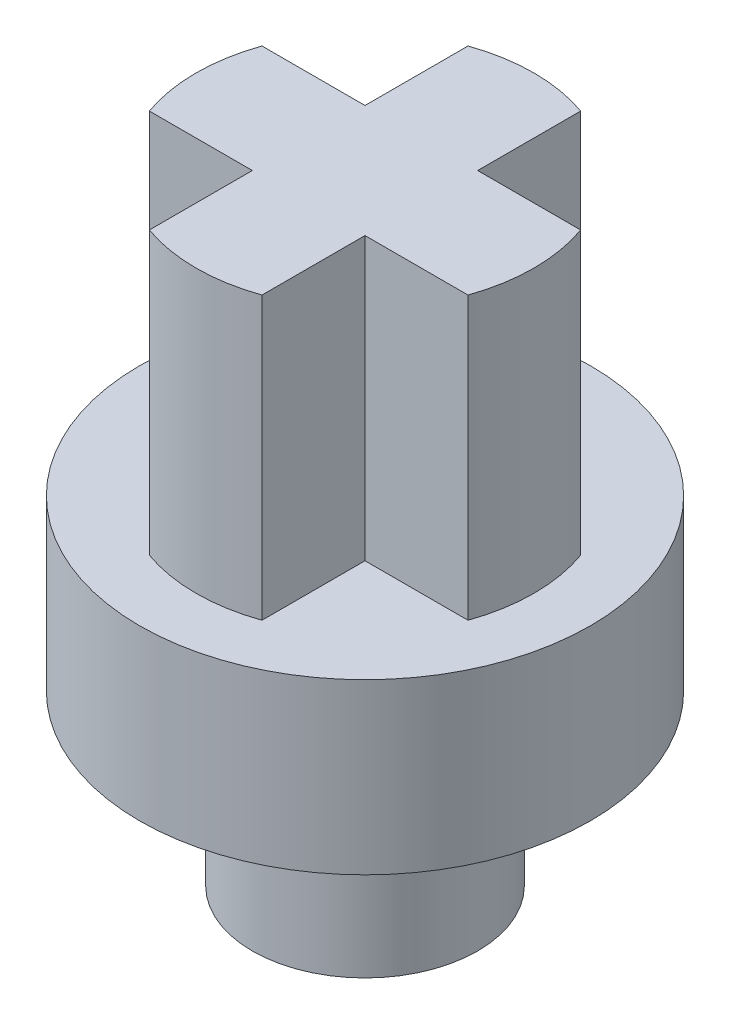
ISO-10303-21;
HEADER;
FILE_DESCRIPTION(('STEP AP214'),'2;1');
FILE_NAME('part.step','',(''),(''),'','','');
FILE_SCHEMA(('AUTOMOTIVE_DESIGN { 1 0 10303 214 1 1 1 1 }'));
ENDSEC;
DATA;
#1=APPLICATION_CONTEXT('core data for automotive mechanical design processes');
#2=APPLICATION_PROTOCOL_DEFINITION('international standard','automotive_design',2000,#1);
#3=PRODUCT_CONTEXT('',#1,'mechanical');
#4=PRODUCT('Part','Part','',(#3));
#5=PRODUCT_RELATED_PRODUCT_CATEGORY('part','',(#4));
#6=PRODUCT_DEFINITION_FORMATION('','',#4);
#7=PRODUCT_DEFINITION_CONTEXT('part definition',#1,'design');
#8=PRODUCT_DEFINITION('design','',#6,#7);
#9=PRODUCT_DEFINITION_SHAPE('','',#8);
#10=(LENGTH_UNIT() NAMED_UNIT(*) SI_UNIT(.MILLI.,.METRE.));
#11=(NAMED_UNIT(*) PLANE_ANGLE_UNIT() SI_UNIT($,.RADIAN.));
#12=(NAMED_UNIT(*) SI_UNIT($,.STERADIAN.) SOLID_ANGLE_UNIT());
#13=UNCERTAINTY_MEASURE_WITH_UNIT(LENGTH_MEASURE(1.E-05),#10,'distance_accuracy_value','');
#14=(GEOMETRIC_REPRESENTATION_CONTEXT(3) GLOBAL_UNCERTAINTY_ASSIGNED_CONTEXT((#13)) GLOBAL_UNIT_ASSIGNED_CONTEXT((#10,
#11,#12)) REPRESENTATION_CONTEXT('',''));
#15=CARTESIAN_POINT('',(0.,0.,0.));
#16=DIRECTION('',(0.,0.,1.));
#17=DIRECTION('',(1.,0.,0.));
#18=AXIS2_PLACEMENT_3D('',#15,#16,#17);
#19=CARTESIAN_POINT('',(-2.,-3.,0.));
#20=DIRECTION('',(0.,-1.,0.));
#21=DIRECTION('',(1.,0.,0.));
#22=AXIS2_PLACEMENT_3D('',#19,#20,#21);
#23=PLANE('',#22);
#24=CARTESIAN_POINT('',(0.,-3.,0.));
#25=DIRECTION('',(0.,1.,0.));
#26=DIRECTION('',(-1.,0.,0.));
#27=AXIS2_PLACEMENT_3D('',#24,#25,#26);
#28=CIRCLE('',#27,2.);
#29=CARTESIAN_POINT('',(-2.,-3.,0.));
#30=VERTEX_POINT('',#29);
#31=EDGE_CURVE('E123',#30,#30,#28,.T.);
#32=ORIENTED_EDGE('',*,*,#31,.F.);
#33=EDGE_LOOP('',(#32));
#34=FACE_BOUND('',#33,.T.);
#35=ADVANCED_FACE('F17',(#34),#23,.T.);
#36=CARTESIAN_POINT('',(0.,5.5,0.));
#37=DIRECTION('',(0.,1.,0.));
#38=DIRECTION('',(-1.,0.,0.));
#39=AXIS2_PLACEMENT_3D('',#36,#37,#38);
#40=CYLINDRICAL_SURFACE('',#39,3.);
#41=DIRECTION('',(0.,1.,0.));
#42=VECTOR('',#41,1.);
#43=CARTESIAN_POINT('',(-2.82842712474619,8.,0.999999999999999));
#44=LINE('',#43,#42);
#45=CARTESIAN_POINT('',(-2.82842712474619,3.,1.));
#46=VERTEX_POINT('',#45);
#47=CARTESIAN_POINT('',(-2.82842712474619,8.,0.999999999999999));
#48=VERTEX_POINT('',#47);
#49=EDGE_CURVE('E142',#46,#48,#44,.T.);
#50=ORIENTED_EDGE('',*,*,#49,.T.);
#51=CARTESIAN_POINT('',(0.,8.,0.));
#52=DIRECTION('',(0.,1.,0.));
#53=DIRECTION('',(-1.,0.,0.));
#54=AXIS2_PLACEMENT_3D('',#51,#52,#53);
#55=CIRCLE('',#54,3.);
#56=CARTESIAN_POINT('',(-2.82842712474619,8.,-1.));
#57=VERTEX_POINT('',#56);
#58=EDGE_CURVE('E115',#57,#48,#55,.T.);
#59=ORIENTED_EDGE('',*,*,#58,.F.);
#60=DIRECTION('',(0.,1.,0.));
#61=VECTOR('',#60,1.);
#62=CARTESIAN_POINT('',(-2.82842712474619,8.,-1.));
#63=LINE('',#62,#61);
#64=CARTESIAN_POINT('',(-2.82842712474619,3.,-1.));
#65=VERTEX_POINT('',#64);
#66=EDGE_CURVE('E117',#57,#65,#63,.F.);
#67=ORIENTED_EDGE('',*,*,#66,.T.);
#68=CARTESIAN_POINT('',(0.,3.,0.));
#69=DIRECTION('',(0.,1.,0.));
#70=DIRECTION('',(-1.,0.,0.));
#71=AXIS2_PLACEMENT_3D('',#68,#69,#70);
#72=CIRCLE('',#71,3.);
#73=EDGE_CURVE('E20',#65,#46,#72,.T.);
#74=ORIENTED_EDGE('',*,*,#73,.T.);
#75=EDGE_LOOP('',(#50,#59,#67,#74));
#76=FACE_BOUND('',#75,.T.);
#77=ADVANCED_FACE('F118',(#76),#40,.T.);
#78=CARTESIAN_POINT('',(0.,8.,0.));
#79=DIRECTION('',(0.,1.,0.));
#80=DIRECTION('',(-1.,0.,0.));
#81=AXIS2_PLACEMENT_3D('',#78,#79,#80);
#82=PLANE('',#81);
#83=DIRECTION('',(1.,0.,0.));
#84=VECTOR('',#83,1.);
#85=CARTESIAN_POINT('',(6.72560461051799,8.,-1.));
#86=LINE('',#85,#84);
#87=CARTESIAN_POINT('',(2.82842712474619,8.,-1.));
#88=VERTEX_POINT('',#87);
#89=CARTESIAN_POINT('',(0.999999999999997,8.,-1.));
#90=VERTEX_POINT('',#89);
#91=EDGE_CURVE('E168',#88,#90,#86,.F.);
#92=ORIENTED_EDGE('',*,*,#91,.T.);
#93=DIRECTION('',(0.,0.,1.));
#94=VECTOR('',#93,1.);
#95=CARTESIAN_POINT('',(0.999999999999997,8.,-1.));
#96=LINE('',#95,#94);
#97=CARTESIAN_POINT('',(0.999999999999996,8.,-2.82842712474619));
#98=VERTEX_POINT('',#97);
#99=EDGE_CURVE('E173',#90,#98,#96,.F.);
#100=ORIENTED_EDGE('',*,*,#99,.T.);
#101=CARTESIAN_POINT('',(0.,8.,0.));
#102=DIRECTION('',(0.,1.,0.));
#103=DIRECTION('',(-1.,0.,0.));
#104=AXIS2_PLACEMENT_3D('',#101,#102,#103);
#105=CIRCLE('',#104,3.);
#106=CARTESIAN_POINT('',(-0.999999999999999,8.,-2.82842712474619));
#107=VERTEX_POINT('',#106);
#108=EDGE_CURVE('E174',#107,#98,#105,.F.);
#109=ORIENTED_EDGE('',*,*,#108,.F.);
#110=DIRECTION('',(0.,0.,1.));
#111=VECTOR('',#110,1.);
#112=CARTESIAN_POINT('',(-1.,8.,-6.72560461051799));
#113=LINE('',#112,#111);
#114=CARTESIAN_POINT('',(-1.,8.,-1.));
#115=VERTEX_POINT('',#114);
#116=EDGE_CURVE('E179',#107,#115,#113,.T.);
#117=ORIENTED_EDGE('',*,*,#116,.T.);
#118=DIRECTION('',(1.,0.,0.));
#119=VECTOR('',#118,1.);
#120=CARTESIAN_POINT('',(-1.,8.,-1.));
#121=LINE('',#120,#119);
#122=EDGE_CURVE('E122',#115,#57,#121,.F.);
#123=ORIENTED_EDGE('',*,*,#122,.T.);
#124=ORIENTED_EDGE('',*,*,#58,.T.);
#125=DIRECTION('',(-1.,0.,0.));
#126=VECTOR('',#125,1.);
#127=CARTESIAN_POINT('',(-6.72560461051799,8.,1.));
#128=LINE('',#127,#126);
#129=CARTESIAN_POINT('',(-1.,8.,0.999999999999999));
#130=VERTEX_POINT('',#129);
#131=EDGE_CURVE('E103',#48,#130,#128,.F.);
#132=ORIENTED_EDGE('',*,*,#131,.T.);
#133=DIRECTION('',(0.,0.,-1.));
#134=VECTOR('',#133,1.);
#135=CARTESIAN_POINT('',(-1.,8.,1.));
#136=LINE('',#135,#134);
#137=CARTESIAN_POINT('',(-0.999999999999999,8.,2.82842712474619));
#138=VERTEX_POINT('',#137);
#139=EDGE_CURVE('E144',#130,#138,#136,.F.);
#140=ORIENTED_EDGE('',*,*,#139,.T.);
#141=CARTESIAN_POINT('',(0.,8.,0.));
#142=DIRECTION('',(0.,1.,0.));
#143=DIRECTION('',(-1.,0.,0.));
#144=AXIS2_PLACEMENT_3D('',#141,#142,#143);
#145=CIRCLE('',#144,3.);
#146=CARTESIAN_POINT('',(0.999999999999998,8.,2.82842712474619));
#147=VERTEX_POINT('',#146);
#148=EDGE_CURVE('E150',#147,#138,#145,.F.);
#149=ORIENTED_EDGE('',*,*,#148,.F.);
#150=DIRECTION('',(0.,0.,1.));
#151=VECTOR('',#150,1.);
#152=CARTESIAN_POINT('',(0.999999999999998,8.,6.72560461051799));
#153=LINE('',#152,#151);
#154=CARTESIAN_POINT('',(0.999999999999997,8.,1.));
#155=VERTEX_POINT('',#154);
#156=EDGE_CURVE('E156',#147,#155,#153,.F.);
#157=ORIENTED_EDGE('',*,*,#156,.T.);
#158=DIRECTION('',(-1.,0.,0.));
#159=VECTOR('',#158,1.);
#160=CARTESIAN_POINT('',(0.999999999999998,8.,1.));
#161=LINE('',#160,#159);
#162=CARTESIAN_POINT('',(2.82842712474619,8.,0.999999999999999));
#163=VERTEX_POINT('',#162);
#164=EDGE_CURVE('E161',#155,#163,#161,.F.);
#165=ORIENTED_EDGE('',*,*,#164,.T.);
#166=CARTESIAN_POINT('',(0.,8.,0.));
#167=DIRECTION('',(0.,1.,0.));
#168=DIRECTION('',(-1.,0.,0.));
#169=AXIS2_PLACEMENT_3D('',#166,#167,#168);
#170=CIRCLE('',#169,3.);
#171=EDGE_CURVE('E162',#88,#163,#170,.F.);
#172=ORIENTED_EDGE('',*,*,#171,.F.);
#173=EDGE_LOOP('',(#92,#100,#109,#117,#123,#124,#132,#140,#149,#157,#165,#172));
#174=FACE_BOUND('',#173,.T.);
#175=ADVANCED_FACE('F227',(#174),#82,.T.);
#176=CARTESIAN_POINT('',(0.,-1.5,0.));
#177=DIRECTION('',(0.,1.,0.));
#178=DIRECTION('',(-1.,0.,0.));
#179=AXIS2_PLACEMENT_3D('',#176,#177,#178);
#180=CYLINDRICAL_SURFACE('',#179,2.);
#181=ORIENTED_EDGE('',*,*,#31,.T.);
#182=EDGE_LOOP('',(#181));
#183=FACE_BOUND('',#182,.T.);
#184=CARTESIAN_POINT('',(0.,0.,0.));
#185=DIRECTION('',(0.,1.,0.));
#186=DIRECTION('',(-1.,0.,0.));
#187=AXIS2_PLACEMENT_3D('',#184,#185,#186);
#188=CIRCLE('',#187,2.);
#189=CARTESIAN_POINT('',(-2.,0.,0.));
#190=VERTEX_POINT('',#189);
#191=EDGE_CURVE('E130',#190,#190,#188,.T.);
#192=ORIENTED_EDGE('',*,*,#191,.F.);
#193=EDGE_LOOP('',(#192));
#194=FACE_BOUND('',#193,.T.);
#195=ADVANCED_FACE('F297',(#183,#194),#180,.T.);
#196=CARTESIAN_POINT('',(-1.,8.,-1.));
#197=DIRECTION('',(0.,0.,1.));
#198=DIRECTION('',(1.,0.,0.));
#199=AXIS2_PLACEMENT_3D('',#196,#197,#198);
#200=PLANE('',#199);
#201=DIRECTION('',(0.,1.,0.));
#202=VECTOR('',#201,1.);
#203=CARTESIAN_POINT('',(-1.,8.,-1.));
#204=LINE('',#203,#202);
#205=CARTESIAN_POINT('',(-0.999999999999999,3.,-0.999999999999999));
#206=VERTEX_POINT('',#205);
#207=EDGE_CURVE('E127',#115,#206,#204,.F.);
#208=ORIENTED_EDGE('',*,*,#207,.T.);
#209=DIRECTION('',(-1.,0.,0.));
#210=VECTOR('',#209,1.);
#211=CARTESIAN_POINT('',(0.,3.,-0.999999999999999));
#212=LINE('',#211,#210);
#213=EDGE_CURVE('E111',#65,#206,#212,.F.);
#214=ORIENTED_EDGE('',*,*,#213,.F.);
#215=ORIENTED_EDGE('',*,*,#66,.F.);
#216=ORIENTED_EDGE('',*,*,#122,.F.);
#217=EDGE_LOOP('',(#208,#214,#215,#216));
#218=FACE_BOUND('',#217,.T.);
#219=ADVANCED_FACE('F125',(#218),#200,.F.);
#220=CARTESIAN_POINT('',(-1.,8.,-6.72560461051799));
#221=DIRECTION('',(1.,0.,0.));
#222=DIRECTION('',(0.,1.,0.));
#223=AXIS2_PLACEMENT_3D('',#220,#221,#222);
#224=PLANE('',#223);
#225=ORIENTED_EDGE('',*,*,#207,.F.);
#226=ORIENTED_EDGE('',*,*,#116,.F.);
#227=DIRECTION('',(0.,1.,0.));
#228=VECTOR('',#227,1.);
#229=CARTESIAN_POINT('',(-0.999999999999998,5.5,-2.82842712474619));
#230=LINE('',#229,#228);
#231=CARTESIAN_POINT('',(-0.999999999999999,3.,-2.82842712474619));
#232=VERTEX_POINT('',#231);
#233=EDGE_CURVE('E175',#232,#107,#230,.T.);
#234=ORIENTED_EDGE('',*,*,#233,.F.);
#235=DIRECTION('',(0.,0.,1.));
#236=VECTOR('',#235,1.);
#237=CARTESIAN_POINT('',(-1.,3.,0.));
#238=LINE('',#237,#236);
#239=EDGE_CURVE('E129',#206,#232,#238,.F.);
#240=ORIENTED_EDGE('',*,*,#239,.F.);
#241=EDGE_LOOP('',(#225,#226,#234,#240));
#242=FACE_BOUND('',#241,.T.);
#243=ADVANCED_FACE('F270',(#242),#224,.F.);
#244=CARTESIAN_POINT('',(0.,5.5,0.));
#245=DIRECTION('',(0.,1.,0.));
#246=DIRECTION('',(-1.,0.,0.));
#247=AXIS2_PLACEMENT_3D('',#244,#245,#246);
#248=CYLINDRICAL_SURFACE('',#247,3.);
#249=ORIENTED_EDGE('',*,*,#233,.T.);
#250=ORIENTED_EDGE('',*,*,#108,.T.);
#251=DIRECTION('',(0.,1.,0.));
#252=VECTOR('',#251,1.);
#253=CARTESIAN_POINT('',(0.999999999999996,8.,-2.82842712474619));
#254=LINE('',#253,#252);
#255=CARTESIAN_POINT('',(0.999999999999998,3.,-2.82842712474619));
#256=VERTEX_POINT('',#255);
#257=EDGE_CURVE('E171',#98,#256,#254,.F.);
#258=ORIENTED_EDGE('',*,*,#257,.T.);
#259=CARTESIAN_POINT('',(0.,3.,0.));
#260=DIRECTION('',(0.,1.,0.));
#261=DIRECTION('',(-1.,0.,0.));
#262=AXIS2_PLACEMENT_3D('',#259,#260,#261);
#263=CIRCLE('',#262,3.);
#264=EDGE_CURVE('E132',#232,#256,#263,.F.);
#265=ORIENTED_EDGE('',*,*,#264,.F.);
#266=EDGE_LOOP('',(#249,#250,#258,#265));
#267=FACE_BOUND('',#266,.T.);
#268=ADVANCED_FACE('F268',(#267),#248,.T.);
#269=CARTESIAN_POINT('',(0.999999999999997,8.,-1.));
#270=DIRECTION('',(-1.,0.,0.));
#271=DIRECTION('',(0.,0.,1.));
#272=AXIS2_PLACEMENT_3D('',#269,#270,#271);
#273=PLANE('',#272);
#274=DIRECTION('',(0.,1.,0.));
#275=VECTOR('',#274,1.);
#276=CARTESIAN_POINT('',(0.999999999999997,8.,-1.));
#277=LINE('',#276,#275);
#278=CARTESIAN_POINT('',(0.999999999999998,3.,-1.));
#279=VERTEX_POINT('',#278);
#280=EDGE_CURVE('E166',#90,#279,#277,.F.);
#281=ORIENTED_EDGE('',*,*,#280,.T.);
#282=DIRECTION('',(0.,0.,1.));
#283=VECTOR('',#282,1.);
#284=CARTESIAN_POINT('',(0.999999999999998,3.,0.));
#285=LINE('',#284,#283);
#286=EDGE_CURVE('E221',#256,#279,#285,.T.);
#287=ORIENTED_EDGE('',*,*,#286,.F.);
#288=ORIENTED_EDGE('',*,*,#257,.F.);
#289=ORIENTED_EDGE('',*,*,#99,.F.);
#290=EDGE_LOOP('',(#281,#287,#288,#289));
#291=FACE_BOUND('',#290,.T.);
#292=ADVANCED_FACE('F263',(#291),#273,.F.);
#293=CARTESIAN_POINT('',(6.72560461051799,8.,-1.));
#294=DIRECTION('',(0.,0.,1.));
#295=DIRECTION('',(1.,0.,0.));
#296=AXIS2_PLACEMENT_3D('',#293,#294,#295);
#297=PLANE('',#296);
#298=ORIENTED_EDGE('',*,*,#280,.F.);
#299=ORIENTED_EDGE('',*,*,#91,.F.);
#300=DIRECTION('',(0.,1.,0.));
#301=VECTOR('',#300,1.);
#302=CARTESIAN_POINT('',(2.82842712474619,5.5,-0.999999999999999));
#303=LINE('',#302,#301);
#304=CARTESIAN_POINT('',(2.82842712474619,3.,-1.));
#305=VERTEX_POINT('',#304);
#306=EDGE_CURVE('E163',#305,#88,#303,.T.);
#307=ORIENTED_EDGE('',*,*,#306,.F.);
#308=DIRECTION('',(-1.,0.,0.));
#309=VECTOR('',#308,1.);
#310=CARTESIAN_POINT('',(0.,3.,-1.));
#311=LINE('',#310,#309);
#312=EDGE_CURVE('E219',#279,#305,#311,.F.);
#313=ORIENTED_EDGE('',*,*,#312,.F.);
#314=EDGE_LOOP('',(#298,#299,#307,#313));
#315=FACE_BOUND('',#314,.T.);
#316=ADVANCED_FACE('F259',(#315),#297,.F.);
#317=CARTESIAN_POINT('',(0.,5.5,0.));
#318=DIRECTION('',(0.,1.,0.));
#319=DIRECTION('',(-1.,0.,0.));
#320=AXIS2_PLACEMENT_3D('',#317,#318,#319);
#321=CYLINDRICAL_SURFACE('',#320,3.);
#322=ORIENTED_EDGE('',*,*,#306,.T.);
#323=ORIENTED_EDGE('',*,*,#171,.T.);
#324=DIRECTION('',(0.,1.,0.));
#325=VECTOR('',#324,1.);
#326=CARTESIAN_POINT('',(2.82842712474619,8.,0.999999999999999));
#327=LINE('',#326,#325);
#328=CARTESIAN_POINT('',(2.82842712474619,3.,0.999999999999999));
#329=VERTEX_POINT('',#328);
#330=EDGE_CURVE('E159',#163,#329,#327,.F.);
#331=ORIENTED_EDGE('',*,*,#330,.T.);
#332=CARTESIAN_POINT('',(0.,3.,0.));
#333=DIRECTION('',(0.,1.,0.));
#334=DIRECTION('',(-1.,0.,0.));
#335=AXIS2_PLACEMENT_3D('',#332,#333,#334);
#336=CIRCLE('',#335,3.);
#337=EDGE_CURVE('E215',#305,#329,#336,.F.);
#338=ORIENTED_EDGE('',*,*,#337,.F.);
#339=EDGE_LOOP('',(#322,#323,#331,#338));
#340=FACE_BOUND('',#339,.T.);
#341=ADVANCED_FACE('F254',(#340),#321,.T.);
#342=CARTESIAN_POINT('',(0.999999999999998,8.,1.));
#343=DIRECTION('',(0.,0.,-1.));
#344=DIRECTION('',(-1.,0.,0.));
#345=AXIS2_PLACEMENT_3D('',#342,#343,#344);
#346=PLANE('',#345);
#347=DIRECTION('',(0.,-1.,0.));
#348=VECTOR('',#347,1.);
#349=CARTESIAN_POINT('',(0.999999999999997,8.,1.));
#350=LINE('',#349,#348);
#351=CARTESIAN_POINT('',(0.999999999999999,3.,0.999999999999999));
#352=VERTEX_POINT('',#351);
#353=EDGE_CURVE('E154',#155,#352,#350,.T.);
#354=ORIENTED_EDGE('',*,*,#353,.T.);
#355=DIRECTION('',(-1.,0.,0.));
#356=VECTOR('',#355,1.);
#357=CARTESIAN_POINT('',(0.,3.,0.999999999999999));
#358=LINE('',#357,#356);
#359=EDGE_CURVE('E218',#329,#352,#358,.T.);
#360=ORIENTED_EDGE('',*,*,#359,.F.);
#361=ORIENTED_EDGE('',*,*,#330,.F.);
#362=ORIENTED_EDGE('',*,*,#164,.F.);
#363=EDGE_LOOP('',(#354,#360,#361,#362));
#364=FACE_BOUND('',#363,.T.);
#365=ADVANCED_FACE('F248',(#364),#346,.F.);
#366=CARTESIAN_POINT('',(0.999999999999998,8.,6.72560461051799));
#367=DIRECTION('',(-1.,0.,0.));
#368=DIRECTION('',(0.,-1.,0.));
#369=AXIS2_PLACEMENT_3D('',#366,#367,#368);
#370=PLANE('',#369);
#371=ORIENTED_EDGE('',*,*,#353,.F.);
#372=ORIENTED_EDGE('',*,*,#156,.F.);
#373=DIRECTION('',(0.,1.,0.));
#374=VECTOR('',#373,1.);
#375=CARTESIAN_POINT('',(0.999999999999999,5.5,2.82842712474619));
#376=LINE('',#375,#374);
#377=CARTESIAN_POINT('',(0.999999999999999,3.,2.82842712474619));
#378=VERTEX_POINT('',#377);
#379=EDGE_CURVE('E151',#378,#147,#376,.T.);
#380=ORIENTED_EDGE('',*,*,#379,.F.);
#381=DIRECTION('',(0.,0.,1.));
#382=VECTOR('',#381,1.);
#383=CARTESIAN_POINT('',(0.999999999999999,3.,0.));
#384=LINE('',#383,#382);
#385=EDGE_CURVE('E214',#352,#378,#384,.T.);
#386=ORIENTED_EDGE('',*,*,#385,.F.);
#387=EDGE_LOOP('',(#371,#372,#380,#386));
#388=FACE_BOUND('',#387,.T.);
#389=ADVANCED_FACE('F244',(#388),#370,.F.);
#390=CARTESIAN_POINT('',(0.,5.5,0.));
#391=DIRECTION('',(0.,1.,0.));
#392=DIRECTION('',(-1.,0.,0.));
#393=AXIS2_PLACEMENT_3D('',#390,#391,#392);
#394=CYLINDRICAL_SURFACE('',#393,3.);
#395=ORIENTED_EDGE('',*,*,#379,.T.);
#396=ORIENTED_EDGE('',*,*,#148,.T.);
#397=DIRECTION('',(0.,1.,0.));
#398=VECTOR('',#397,1.);
#399=CARTESIAN_POINT('',(-0.999999999999999,8.,2.82842712474619));
#400=LINE('',#399,#398);
#401=CARTESIAN_POINT('',(-0.999999999999998,3.,2.82842712474619));
#402=VERTEX_POINT('',#401);
#403=EDGE_CURVE('E148',#138,#402,#400,.F.);
#404=ORIENTED_EDGE('',*,*,#403,.T.);
#405=CARTESIAN_POINT('',(0.,3.,0.));
#406=DIRECTION('',(0.,1.,0.));
#407=DIRECTION('',(-1.,0.,0.));
#408=AXIS2_PLACEMENT_3D('',#405,#406,#407);
#409=CIRCLE('',#408,3.);
#410=EDGE_CURVE('E210',#378,#402,#409,.F.);
#411=ORIENTED_EDGE('',*,*,#410,.F.);
#412=EDGE_LOOP('',(#395,#396,#404,#411));
#413=FACE_BOUND('',#412,.T.);
#414=ADVANCED_FACE('F239',(#413),#394,.T.);
#415=CARTESIAN_POINT('',(-1.,8.,1.));
#416=DIRECTION('',(1.,0.,0.));
#417=DIRECTION('',(0.,0.,-1.));
#418=AXIS2_PLACEMENT_3D('',#415,#416,#417);
#419=PLANE('',#418);
#420=DIRECTION('',(0.,1.,0.));
#421=VECTOR('',#420,1.);
#422=CARTESIAN_POINT('',(-1.,8.,0.999999999999999));
#423=LINE('',#422,#421);
#424=CARTESIAN_POINT('',(-0.999999999999999,3.,0.999999999999999));
#425=VERTEX_POINT('',#424);
#426=EDGE_CURVE('E135',#130,#425,#423,.F.);
#427=ORIENTED_EDGE('',*,*,#426,.T.);
#428=DIRECTION('',(0.,0.,1.));
#429=VECTOR('',#428,1.);
#430=CARTESIAN_POINT('',(-0.999999999999998,3.,0.));
#431=LINE('',#430,#429);
#432=EDGE_CURVE('E213',#402,#425,#431,.F.);
#433=ORIENTED_EDGE('',*,*,#432,.F.);
#434=ORIENTED_EDGE('',*,*,#403,.F.);
#435=ORIENTED_EDGE('',*,*,#139,.F.);
#436=EDGE_LOOP('',(#427,#433,#434,#435));
#437=FACE_BOUND('',#436,.T.);
#438=ADVANCED_FACE('F233',(#437),#419,.F.);
#439=CARTESIAN_POINT('',(-6.72560461051799,8.,1.));
#440=DIRECTION('',(0.,0.,-1.));
#441=DIRECTION('',(-1.,0.,0.));
#442=AXIS2_PLACEMENT_3D('',#439,#440,#441);
#443=PLANE('',#442);
#444=ORIENTED_EDGE('',*,*,#426,.F.);
#445=ORIENTED_EDGE('',*,*,#131,.F.);
#446=ORIENTED_EDGE('',*,*,#49,.F.);
#447=DIRECTION('',(-1.,0.,0.));
#448=VECTOR('',#447,1.);
#449=CARTESIAN_POINT('',(0.,3.,1.));
#450=LINE('',#449,#448);
#451=EDGE_CURVE('E114',#425,#46,#450,.T.);
#452=ORIENTED_EDGE('',*,*,#451,.F.);
#453=EDGE_LOOP('',(#444,#445,#446,#452));
#454=FACE_BOUND('',#453,.T.);
#455=ADVANCED_FACE('F230',(#454),#443,.F.);
#456=CARTESIAN_POINT('',(-4.,0.,0.));
#457=DIRECTION('',(0.,-1.,0.));
#458=DIRECTION('',(1.,0.,0.));
#459=AXIS2_PLACEMENT_3D('',#456,#457,#458);
#460=PLANE('',#459);
#461=CARTESIAN_POINT('',(0.,0.,0.));
#462=DIRECTION('',(0.,1.,0.));
#463=DIRECTION('',(-1.,0.,0.));
#464=AXIS2_PLACEMENT_3D('',#461,#462,#463);
#465=CIRCLE('',#464,4.);
#466=CARTESIAN_POINT('',(-4.,0.,0.));
#467=VERTEX_POINT('',#466);
#468=EDGE_CURVE('E26',#467,#467,#465,.T.);
#469=ORIENTED_EDGE('',*,*,#468,.F.);
#470=EDGE_LOOP('',(#469));
#471=FACE_BOUND('',#470,.T.);
#472=ORIENTED_EDGE('',*,*,#191,.T.);
#473=EDGE_LOOP('',(#472));
#474=FACE_BOUND('',#473,.T.);
#475=ADVANCED_FACE('F306',(#471,#474),#460,.T.);
#476=CARTESIAN_POINT('',(0.,3.,0.));
#477=DIRECTION('',(0.,1.,0.));
#478=DIRECTION('',(-1.,0.,0.));
#479=AXIS2_PLACEMENT_3D('',#476,#477,#478);
#480=PLANE('',#479);
#481=CARTESIAN_POINT('',(0.,3.,0.));
#482=DIRECTION('',(0.,1.,0.));
#483=DIRECTION('',(-1.,0.,0.));
#484=AXIS2_PLACEMENT_3D('',#481,#482,#483);
#485=CIRCLE('',#484,4.);
#486=CARTESIAN_POINT('',(-4.,3.,0.));
#487=VERTEX_POINT('',#486);
#488=EDGE_CURVE('E11',#487,#487,#485,.F.);
#489=ORIENTED_EDGE('',*,*,#488,.F.);
#490=EDGE_LOOP('',(#489));
#491=FACE_BOUND('',#490,.T.);
#492=ORIENTED_EDGE('',*,*,#73,.F.);
#493=ORIENTED_EDGE('',*,*,#213,.T.);
#494=ORIENTED_EDGE('',*,*,#239,.T.);
#495=ORIENTED_EDGE('',*,*,#264,.T.);
#496=ORIENTED_EDGE('',*,*,#286,.T.);
#497=ORIENTED_EDGE('',*,*,#312,.T.);
#498=ORIENTED_EDGE('',*,*,#337,.T.);
#499=ORIENTED_EDGE('',*,*,#359,.T.);
#500=ORIENTED_EDGE('',*,*,#385,.T.);
#501=ORIENTED_EDGE('',*,*,#410,.T.);
#502=ORIENTED_EDGE('',*,*,#432,.T.);
#503=ORIENTED_EDGE('',*,*,#451,.T.);
#504=EDGE_LOOP('',(#492,#493,#494,#495,#496,#497,#498,#499,#500,#501,#502,#503));
#505=FACE_BOUND('',#504,.T.);
#506=ADVANCED_FACE('F108',(#491,#505),#480,.T.);
#507=CARTESIAN_POINT('',(0.,1.5,0.));
#508=DIRECTION('',(0.,1.,0.));
#509=DIRECTION('',(-1.,0.,0.));
#510=AXIS2_PLACEMENT_3D('',#507,#508,#509);
#511=CYLINDRICAL_SURFACE('',#510,4.);
#512=ORIENTED_EDGE('',*,*,#468,.T.);
#513=EDGE_LOOP('',(#512));
#514=FACE_BOUND('',#513,.T.);
#515=ORIENTED_EDGE('',*,*,#488,.T.);
#516=EDGE_LOOP('',(#515));
#517=FACE_BOUND('',#516,.T.);
#518=ADVANCED_FACE('F299',(#514,#517),#511,.T.);
#519=CLOSED_SHELL('',(#35,#77,#175,#195,#219,#243,#268,#292,#316,#341,#365,#389,#414,#438,#455,
#475,#506,#518));
#520=MANIFOLD_SOLID_BREP('B1',#519);
#521=ADVANCED_BREP_SHAPE_REPRESENTATION('',(#18,#520),#14);
#522=SHAPE_DEFINITION_REPRESENTATION(#9,#521);
ENDSEC;
END-ISO-10303-21;
